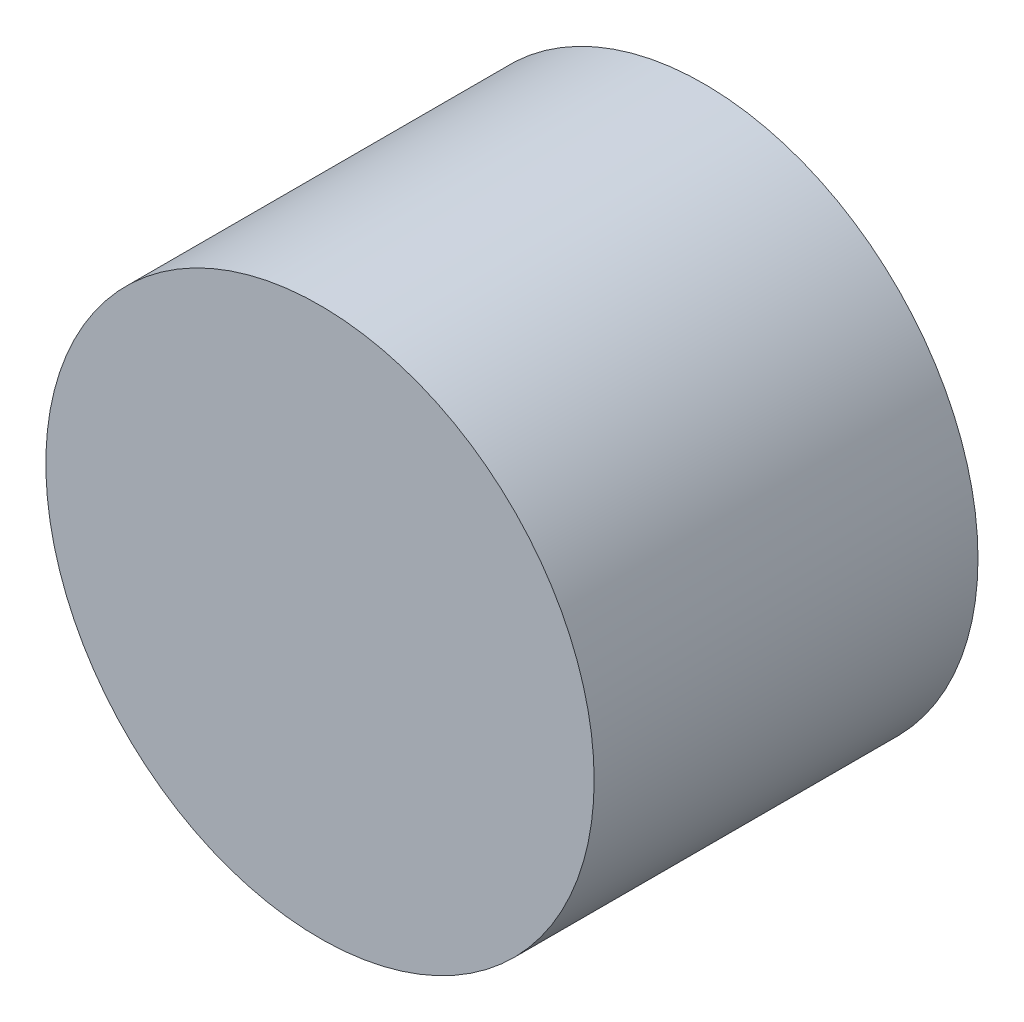
ISO-10303-21;
HEADER;
FILE_DESCRIPTION(('STEP AP214'),'2;1');
FILE_NAME('part.step','',(''),(''),'','','');
FILE_SCHEMA(('AUTOMOTIVE_DESIGN { 1 0 10303 214 1 1 1 1 }'));
ENDSEC;
DATA;
#1=APPLICATION_CONTEXT('core data for automotive mechanical design processes');
#2=APPLICATION_PROTOCOL_DEFINITION('international standard','automotive_design',2000,#1);
#3=PRODUCT_CONTEXT('',#1,'mechanical');
#4=PRODUCT('Part','Part','',(#3));
#5=PRODUCT_RELATED_PRODUCT_CATEGORY('part','',(#4));
#6=PRODUCT_DEFINITION_FORMATION('','',#4);
#7=PRODUCT_DEFINITION_CONTEXT('part definition',#1,'design');
#8=PRODUCT_DEFINITION('design','',#6,#7);
#9=PRODUCT_DEFINITION_SHAPE('','',#8);
#10=(LENGTH_UNIT() NAMED_UNIT(*) SI_UNIT(.MILLI.,.METRE.));
#11=(NAMED_UNIT(*) PLANE_ANGLE_UNIT() SI_UNIT($,.RADIAN.));
#12=(NAMED_UNIT(*) SI_UNIT($,.STERADIAN.) SOLID_ANGLE_UNIT());
#13=UNCERTAINTY_MEASURE_WITH_UNIT(LENGTH_MEASURE(1.E-05),#10,'distance_accuracy_value','');
#14=(GEOMETRIC_REPRESENTATION_CONTEXT(3) GLOBAL_UNCERTAINTY_ASSIGNED_CONTEXT((#13)) GLOBAL_UNIT_ASSIGNED_CONTEXT((#10,
#11,#12)) REPRESENTATION_CONTEXT('',''));
#15=CARTESIAN_POINT('',(0.,0.,0.));
#16=DIRECTION('',(0.,0.,1.));
#17=DIRECTION('',(1.,0.,0.));
#18=AXIS2_PLACEMENT_3D('',#15,#16,#17);
#19=CARTESIAN_POINT('',(0.,0.,3.5));
#20=DIRECTION('',(0.,0.,-1.));
#21=DIRECTION('',(-1.,0.,0.));
#22=AXIS2_PLACEMENT_3D('',#19,#20,#21);
#23=CYLINDRICAL_SURFACE('',#22,2.5);
#24=CARTESIAN_POINT('',(0.,0.,3.5));
#25=DIRECTION('',(0.,0.,1.));
#26=DIRECTION('',(1.,0.,0.));
#27=AXIS2_PLACEMENT_3D('',#24,#25,#26);
#28=CIRCLE('',#27,2.5);
#29=CARTESIAN_POINT('',(2.5,0.,3.5));
#30=VERTEX_POINT('',#29);
#31=EDGE_CURVE('E10',#30,#30,#28,.T.);
#32=ORIENTED_EDGE('',*,*,#31,.F.);
#33=EDGE_LOOP('',(#32));
#34=FACE_BOUND('',#33,.T.);
#35=CARTESIAN_POINT('',(0.,0.,0.));
#36=DIRECTION('',(0.,0.,1.));
#37=DIRECTION('',(1.,0.,0.));
#38=AXIS2_PLACEMENT_3D('',#35,#36,#37);
#39=CIRCLE('',#38,2.5);
#40=CARTESIAN_POINT('',(2.5,0.,0.));
#41=VERTEX_POINT('',#40);
#42=EDGE_CURVE('E35',#41,#41,#39,.T.);
#43=ORIENTED_EDGE('',*,*,#42,.T.);
#44=EDGE_LOOP('',(#43));
#45=FACE_BOUND('',#44,.T.);
#46=ADVANCED_FACE('F32',(#34,#45),#23,.T.);
#47=CARTESIAN_POINT('',(0.,0.,3.5));
#48=DIRECTION('',(0.,0.,1.));
#49=DIRECTION('',(1.,0.,0.));
#50=AXIS2_PLACEMENT_3D('',#47,#48,#49);
#51=PLANE('',#50);
#52=ORIENTED_EDGE('',*,*,#31,.T.);
#53=EDGE_LOOP('',(#52));
#54=FACE_BOUND('',#53,.T.);
#55=ADVANCED_FACE('F47',(#54),#51,.T.);
#56=CARTESIAN_POINT('',(0.,0.,0.));
#57=DIRECTION('',(0.,0.,1.));
#58=DIRECTION('',(1.,0.,0.));
#59=AXIS2_PLACEMENT_3D('',#56,#57,#58);
#60=PLANE('',#59);
#61=ORIENTED_EDGE('',*,*,#42,.F.);
#62=EDGE_LOOP('',(#61));
#63=FACE_BOUND('',#62,.T.);
#64=ADVANCED_FACE('F45',(#63),#60,.F.);
#65=CLOSED_SHELL('',(#46,#55,#64));
#66=MANIFOLD_SOLID_BREP('B2',#65);
#67=ADVANCED_BREP_SHAPE_REPRESENTATION('',(#18,#66),#14);
#68=SHAPE_DEFINITION_REPRESENTATION(#9,#67);
ENDSEC;
END-ISO-10303-21;
